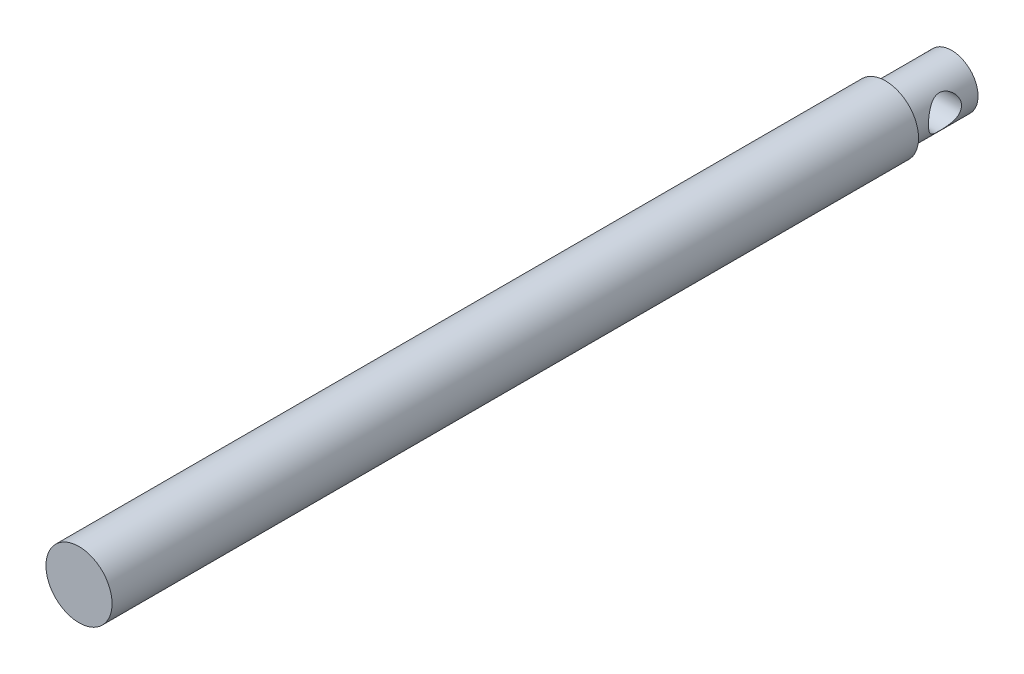
ISO-10303-21;
HEADER;
FILE_DESCRIPTION(('STEP AP214'),'2;1');
FILE_NAME('part.step','',(''),(''),'','','');
FILE_SCHEMA(('AUTOMOTIVE_DESIGN { 1 0 10303 214 1 1 1 1 }'));
ENDSEC;
DATA;
#1=APPLICATION_CONTEXT('core data for automotive mechanical design processes');
#2=APPLICATION_PROTOCOL_DEFINITION('international standard','automotive_design',2000,#1);
#3=PRODUCT_CONTEXT('',#1,'mechanical');
#4=PRODUCT('Part','Part','',(#3));
#5=PRODUCT_RELATED_PRODUCT_CATEGORY('part','',(#4));
#6=PRODUCT_DEFINITION_FORMATION('','',#4);
#7=PRODUCT_DEFINITION_CONTEXT('part definition',#1,'design');
#8=PRODUCT_DEFINITION('design','',#6,#7);
#9=PRODUCT_DEFINITION_SHAPE('','',#8);
#10=(LENGTH_UNIT() NAMED_UNIT(*) SI_UNIT(.MILLI.,.METRE.));
#11=(NAMED_UNIT(*) PLANE_ANGLE_UNIT() SI_UNIT($,.RADIAN.));
#12=(NAMED_UNIT(*) SI_UNIT($,.STERADIAN.) SOLID_ANGLE_UNIT());
#13=UNCERTAINTY_MEASURE_WITH_UNIT(LENGTH_MEASURE(1.E-05),#10,'distance_accuracy_value','');
#14=(GEOMETRIC_REPRESENTATION_CONTEXT(3) GLOBAL_UNCERTAINTY_ASSIGNED_CONTEXT((#13)) GLOBAL_UNIT_ASSIGNED_CONTEXT((#10,
#11,#12)) REPRESENTATION_CONTEXT('',''));
#15=CARTESIAN_POINT('',(0.,0.,0.));
#16=DIRECTION('',(0.,0.,1.));
#17=DIRECTION('',(1.,0.,0.));
#18=AXIS2_PLACEMENT_3D('',#15,#16,#17);
#19=CARTESIAN_POINT('',(0.,0.,122.));
#20=DIRECTION('',(0.,0.,-1.));
#21=DIRECTION('',(-1.,0.,0.));
#22=AXIS2_PLACEMENT_3D('',#19,#20,#21);
#23=CYLINDRICAL_SURFACE('',#22,5.);
#24=CARTESIAN_POINT('',(0.,0.,122.));
#25=DIRECTION('',(0.,0.,1.));
#26=DIRECTION('',(1.,0.,0.));
#27=AXIS2_PLACEMENT_3D('',#24,#25,#26);
#28=CIRCLE('',#27,5.);
#29=CARTESIAN_POINT('',(5.,0.,122.));
#30=VERTEX_POINT('',#29);
#31=EDGE_CURVE('E44',#30,#30,#28,.T.);
#32=ORIENTED_EDGE('',*,*,#31,.F.);
#33=EDGE_LOOP('',(#32));
#34=FACE_BOUND('',#33,.T.);
#35=CARTESIAN_POINT('',(0.,0.,0.));
#36=DIRECTION('',(0.,0.,1.));
#37=DIRECTION('',(1.,0.,0.));
#38=AXIS2_PLACEMENT_3D('',#35,#36,#37);
#39=CIRCLE('',#38,5.);
#40=CARTESIAN_POINT('',(5.,0.,0.));
#41=VERTEX_POINT('',#40);
#42=EDGE_CURVE('E49',#41,#41,#39,.T.);
#43=ORIENTED_EDGE('',*,*,#42,.T.);
#44=EDGE_LOOP('',(#43));
#45=FACE_BOUND('',#44,.T.);
#46=ADVANCED_FACE('F32',(#34,#45),#23,.T.);
#47=CARTESIAN_POINT('',(0.,0.,122.));
#48=DIRECTION('',(0.,0.,1.));
#49=DIRECTION('',(1.,0.,0.));
#50=AXIS2_PLACEMENT_3D('',#47,#48,#49);
#51=PLANE('',#50);
#52=ORIENTED_EDGE('',*,*,#31,.T.);
#53=EDGE_LOOP('',(#52));
#54=FACE_BOUND('',#53,.T.);
#55=ADVANCED_FACE('F79',(#54),#51,.T.);
#56=CARTESIAN_POINT('',(0.,0.,0.));
#57=DIRECTION('',(0.,0.,1.));
#58=DIRECTION('',(1.,0.,0.));
#59=AXIS2_PLACEMENT_3D('',#56,#57,#58);
#60=PLANE('',#59);
#61=CARTESIAN_POINT('',(0.,0.,0.));
#62=DIRECTION('',(0.,0.,-1.));
#63=DIRECTION('',(-1.,0.,0.));
#64=AXIS2_PLACEMENT_3D('',#61,#62,#63);
#65=CIRCLE('',#64,4.);
#66=CARTESIAN_POINT('',(-4.,0.,0.));
#67=VERTEX_POINT('',#66);
#68=EDGE_CURVE('E10',#67,#67,#65,.T.);
#69=ORIENTED_EDGE('',*,*,#68,.F.);
#70=EDGE_LOOP('',(#69));
#71=FACE_BOUND('',#70,.T.);
#72=ORIENTED_EDGE('',*,*,#42,.F.);
#73=EDGE_LOOP('',(#72));
#74=FACE_BOUND('',#73,.T.);
#75=ADVANCED_FACE('F75',(#71,#74),#60,.F.);
#76=CARTESIAN_POINT('',(0.,0.,-10.));
#77=DIRECTION('',(0.,0.,1.));
#78=DIRECTION('',(1.,0.,0.));
#79=AXIS2_PLACEMENT_3D('',#76,#77,#78);
#80=CYLINDRICAL_SURFACE('',#79,4.);
#81=CARTESIAN_POINT('',(4.,0.,-7.5));
#82=CARTESIAN_POINT('',(3.99999041333571,-0.127017476559871,-7.49998952385639));
#83=CARTESIAN_POINT('',(3.9938860659399,-0.254191951791703,-7.49025350009832));
#84=CARTESIAN_POINT('',(3.97004375552586,-0.504637456621344,-7.45182887031573));
#85=CARTESIAN_POINT('',(3.95228361873137,-0.627900575825985,-7.42310413973879));
#86=CARTESIAN_POINT('',(3.90691695293563,-0.866410868269161,-7.34837714671246));
#87=CARTESIAN_POINT('',(3.87935918690877,-0.981694420709429,-7.30246039021243));
#88=CARTESIAN_POINT('',(3.81669199838277,-1.20252080434994,-7.19522833250853));
#89=CARTESIAN_POINT('',(3.7815834126609,-1.30806471304098,-7.13391473744688));
#90=CARTESIAN_POINT('',(3.70340304945467,-1.51594836437078,-6.9922268434089));
#91=CARTESIAN_POINT('',(3.65991924217889,-1.61735911616791,-6.91072139729824));
#92=CARTESIAN_POINT('',(3.57062700058922,-1.80597275567284,-6.73356165374148));
#93=CARTESIAN_POINT('',(3.52481549782957,-1.89315621594404,-6.63788834426107));
#94=CARTESIAN_POINT('',(3.42860837235627,-2.06285746302521,-6.4199322107088));
#95=CARTESIAN_POINT('',(3.37843221966147,-2.14314412018317,-6.29580042656906));
#96=CARTESIAN_POINT('',(3.28660396278105,-2.28147932079995,-6.03287036932165));
#97=CARTESIAN_POINT('',(3.2449375200046,-2.33956541787438,-5.89409737483202));
#98=CARTESIAN_POINT('',(3.18619151248815,-2.41866801180576,-5.64237895245429));
#99=CARTESIAN_POINT('',(3.16553811970886,-2.44539104794679,-5.53206636308169));
#100=CARTESIAN_POINT('',(3.1356271466086,-2.4836368711914,-5.30738814861931));
#101=CARTESIAN_POINT('',(3.12635347378457,-2.49518112485637,-5.19302848282679));
#102=CARTESIAN_POINT('',(3.12059771534501,-2.50237836690497,-4.96317396712363));
#103=CARTESIAN_POINT('',(3.12414917427958,-2.49798968200884,-4.84767692942204));
#104=CARTESIAN_POINT('',(3.14354804883411,-2.47352633347829,-4.61937979127337));
#105=CARTESIAN_POINT('',(3.15940531965489,-2.45343909745149,-4.50658192715007));
#106=CARTESIAN_POINT('',(3.20065145822146,-2.3993620946426,-4.28912310325641));
#107=CARTESIAN_POINT('',(3.22581428653572,-2.36570043522604,-4.18433512028263));
#108=CARTESIAN_POINT('',(3.28291134443418,-2.28580369589507,-3.98167760352679));
#109=CARTESIAN_POINT('',(3.31484796808523,-2.2395641689404,-3.88381053215654));
#110=CARTESIAN_POINT('',(3.38909625095658,-2.12589830407261,-3.67833359248984));
#111=CARTESIAN_POINT('',(3.4322315520855,-2.05612773657746,-3.57231894814762));
#112=CARTESIAN_POINT('',(3.52011451554715,-1.90176111958637,-3.3723388730236));
#113=CARTESIAN_POINT('',(3.56486379714022,-1.81714983251341,-3.27838599995486));
#114=CARTESIAN_POINT('',(3.65959667460597,-1.61904732877734,-3.08939899041739));
#115=CARTESIAN_POINT('',(3.70922571443728,-1.50309447420016,-2.9967440572784));
#116=CARTESIAN_POINT('',(3.8005660184067,-1.25426444468514,-2.83228820636898));
#117=CARTESIAN_POINT('',(3.84228039228673,-1.12139395127005,-2.76047909219051));
#118=CARTESIAN_POINT('',(3.89435975869902,-0.915775751567441,-2.67265404336502));
#119=CARTESIAN_POINT('',(3.90966874385268,-0.848193583187391,-2.64716571356961));
#120=CARTESIAN_POINT('',(3.93701839875445,-0.710492049478444,-2.60199234952136));
#121=CARTESIAN_POINT('',(3.94906095588034,-0.640374175967898,-2.58230396342918));
#122=CARTESIAN_POINT('',(3.96949699527849,-0.498239019538471,-2.54906583835761));
#123=CARTESIAN_POINT('',(3.97789374843884,-0.426223500915275,-2.535510596474));
#124=CARTESIAN_POINT('',(3.99078766491331,-0.280965673560732,-2.51475370668643));
#125=CARTESIAN_POINT('',(3.99528549435853,-0.207723576570751,-2.5075509734527));
#126=CARTESIAN_POINT('',(4.00193773474167,-0.00911917689680599,-2.49689069535646));
#127=CARTESIAN_POINT('',(4.000238122366,0.116782016705694,-2.49959963687648));
#128=CARTESIAN_POINT('',(3.98518313408306,0.365967766011666,-2.52375966446545));
#129=CARTESIAN_POINT('',(3.97182855210102,0.489252499359949,-2.54520947392473));
#130=CARTESIAN_POINT('',(3.93547975555369,0.7250361940026,-2.60447858798278));
#131=CARTESIAN_POINT('',(3.91288306371126,0.837768421062912,-2.64162472076979));
#132=CARTESIAN_POINT('',(3.85991402897874,1.05527816125332,-2.73059237131243));
#133=CARTESIAN_POINT('',(3.82954038411642,1.16005433861599,-2.78241634650143));
#134=CARTESIAN_POINT('',(3.75980014020658,1.37016761969194,-2.90503053750783));
#135=CARTESIAN_POINT('',(3.71983526755373,1.47449380296905,-2.97720717227503));
#136=CARTESIAN_POINT('',(3.63613942885727,1.67028541330073,-3.13558769646929));
#137=CARTESIAN_POINT('',(3.59240430473134,1.76173634038025,-3.22180716888569));
#138=CARTESIAN_POINT('',(3.49811738486729,1.94294835276253,-3.42027008984565));
#139=CARTESIAN_POINT('',(3.44749766579192,2.03053702733638,-3.53447441549752));
#140=CARTESIAN_POINT('',(3.35133525746893,2.18560704916439,-3.77775156698257));
#141=CARTESIAN_POINT('',(3.30578906708369,2.25310231693768,-3.90681401289132));
#142=CARTESIAN_POINT('',(3.23467060578839,2.35369543821018,-4.14938429659957));
#143=CARTESIAN_POINT('',(3.20691272363805,2.39103791720685,-4.26048150138871));
#144=CARTESIAN_POINT('',(3.16210061351252,2.45000216420747,-4.48878629161345));
#145=CARTESIAN_POINT('',(3.1450296652982,2.47164849805251,-4.60598401968943));
#146=CARTESIAN_POINT('',(3.124126499326,2.49802767469226,-4.8441805529704));
#147=CARTESIAN_POINT('',(3.12037003193165,2.50266374586469,-4.96519716787993));
#148=CARTESIAN_POINT('',(3.12698126375719,2.49439556773531,-5.20626192382951));
#149=CARTESIAN_POINT('',(3.13735365770479,2.48148548821457,-5.32630972961936));
#150=CARTESIAN_POINT('',(3.16910777009989,2.44076547086104,-5.55205957943611));
#151=CARTESIAN_POINT('',(3.18953614189074,2.41423847191721,-5.65813856450238));
#152=CARTESIAN_POINT('',(3.23835062785226,2.34835238743426,-5.86427015751826));
#153=CARTESIAN_POINT('',(3.26674005971309,2.3089879509078,-5.96432023181727));
#154=CARTESIAN_POINT('',(3.33327797617852,2.21205415803959,-6.17119332433813));
#155=CARTESIAN_POINT('',(3.3722442852408,2.15267427981667,-6.27689994626374));
#156=CARTESIAN_POINT('',(3.45335445323995,2.01999894889208,-6.47787738570926));
#157=CARTESIAN_POINT('',(3.49550086438999,1.94669224594686,-6.57313966737408));
#158=CARTESIAN_POINT('',(3.58803675426846,1.77134669685941,-6.77002558379843));
#159=CARTESIAN_POINT('',(3.63840488260278,1.66649284489893,-6.86916976153929));
#160=CARTESIAN_POINT('',(3.7339805383823,1.43961937990848,-7.04900159612506));
#161=CARTESIAN_POINT('',(3.77918486147258,1.3175892119665,-7.12967782367752));
#162=CARTESIAN_POINT('',(3.83959214728415,1.12346357942551,-7.23456343855875));
#163=CARTESIAN_POINT('',(3.85851834157058,1.05679601158094,-7.26687480004699));
#164=CARTESIAN_POINT('',(3.89335165397882,0.920199584374063,-7.32567225182379));
#165=CARTESIAN_POINT('',(3.9092605122592,0.850272633931985,-7.3521617011351));
#166=CARTESIAN_POINT('',(3.93753374175517,0.707873688437768,-7.39885714446216));
#167=CARTESIAN_POINT('',(3.94990764965183,0.635409144572266,-7.41908005724566));
#168=CARTESIAN_POINT('',(3.97075677458059,0.488456989557116,-7.45297545558237));
#169=CARTESIAN_POINT('',(3.97923486692924,0.413970913545529,-7.46665277243948));
#170=CARTESIAN_POINT('',(3.99038271291772,0.282852605094051,-7.48459041022673));
#171=CARTESIAN_POINT('',(3.99398159517595,0.226501515914869,-7.49036153025218));
#172=CARTESIAN_POINT('',(3.99879245372932,0.113444074519046,-7.49806878362715));
#173=CARTESIAN_POINT('',(4.00000428228699,0.0567377005313053,-7.50000467961036));
#174=CARTESIAN_POINT('',(4.,0.,-7.5));
#175=B_SPLINE_CURVE_WITH_KNOTS('',3,(#81,#82,#83,#84,#85,#86,#87,#88,#89,#90,#91,#92,#93,#94,
#95,#96,#97,#98,#99,#100,#101,#102,#103,#104,#105,#106,#107,#108,#109,#110,#111,#112,#113,#114,
#115,#116,#117,#118,#119,#120,#121,#122,#123,#124,#125,#126,#127,#128,#129,#130,#131,#132,#133,
#134,#135,#136,#137,#138,#139,#140,#141,#142,#143,#144,#145,#146,#147,#148,#149,#150,#151,#152,
#153,#154,#155,#156,#157,#158,#159,#160,#161,#162,#163,#164,#165,#166,#167,#168,#169,#170,#171,
#172,#173,#174),.UNSPECIFIED.,.T.,.F.,(4,2,2,2,2,2,2,2,2,2,2,2,2,2,2,2,2,2,2,2,2,2,2,2,2,2,2,2,
2,2,2,2,2,2,2,2,2,2,2,2,2,2,2,2,2,2,4),(0.,0.380824602868265,0.762375788256923,1.14205397519027,
1.52169010807759,1.93164374107243,2.34215256651403,2.80825951705947,3.27357449214021,
3.61824017759434,3.96241789414782,4.30749646997556,4.65285169010166,4.99031678920873,
5.32790135816066,5.72854900708719,6.12961045150363,6.59684361399043,7.06389281455722,
7.28510978359955,7.50619865744383,7.72708876613707,7.94794112831293,8.32363778110177,
8.69930884379593,9.06028425977629,9.42132014771965,9.81879878896137,10.216721545704,
10.6724083464246,11.1277787130885,11.4876929754247,11.8470427174174,12.2084336629143,
12.5699447204276,12.9023575499051,13.2349091154192,13.6156046298899,13.9966089922257,
14.4531049498526,14.9098826607203,15.138984863948,15.3679545348469,15.5963005225022,
15.8244777070605,15.994578512822,16.1646898459841),.UNSPECIFIED.);
#176=CARTESIAN_POINT('',(4.,0.,-7.5));
#177=VERTEX_POINT('',#176);
#178=EDGE_CURVE('E35',#177,#177,#175,.T.);
#179=ORIENTED_EDGE('',*,*,#178,.T.);
#180=EDGE_LOOP('',(#179));
#181=FACE_BOUND('',#180,.T.);
#182=CARTESIAN_POINT('',(-4.,0.,-7.5));
#183=CARTESIAN_POINT('',(-3.99999041333571,0.127017476559871,-7.49998952385639));
#184=CARTESIAN_POINT('',(-3.9938860659399,0.254191951791703,-7.49025350009832));
#185=CARTESIAN_POINT('',(-3.97004375552586,0.504637456621344,-7.45182887031573));
#186=CARTESIAN_POINT('',(-3.95228361873137,0.627900575825985,-7.42310413973879));
#187=CARTESIAN_POINT('',(-3.90691695293563,0.866410868269161,-7.34837714671246));
#188=CARTESIAN_POINT('',(-3.87935918690877,0.981694420709429,-7.30246039021243));
#189=CARTESIAN_POINT('',(-3.81669199838277,1.20252080434994,-7.19522833250853));
#190=CARTESIAN_POINT('',(-3.7815834126609,1.30806471304098,-7.13391473744688));
#191=CARTESIAN_POINT('',(-3.70340304945467,1.51594836437078,-6.9922268434089));
#192=CARTESIAN_POINT('',(-3.65991924217889,1.61735911616791,-6.91072139729824));
#193=CARTESIAN_POINT('',(-3.57062700058922,1.80597275567284,-6.73356165374148));
#194=CARTESIAN_POINT('',(-3.52481549782957,1.89315621594404,-6.63788834426107));
#195=CARTESIAN_POINT('',(-3.42860837235627,2.06285746302521,-6.4199322107088));
#196=CARTESIAN_POINT('',(-3.37843221966147,2.14314412018317,-6.29580042656906));
#197=CARTESIAN_POINT('',(-3.28660396278105,2.28147932079995,-6.03287036932165));
#198=CARTESIAN_POINT('',(-3.2449375200046,2.33956541787438,-5.89409737483202));
#199=CARTESIAN_POINT('',(-3.18619151248815,2.41866801180576,-5.64237895245429));
#200=CARTESIAN_POINT('',(-3.16553811970886,2.44539104794679,-5.53206636308169));
#201=CARTESIAN_POINT('',(-3.1356271466086,2.4836368711914,-5.30738814861931));
#202=CARTESIAN_POINT('',(-3.12635347378457,2.49518112485637,-5.19302848282679));
#203=CARTESIAN_POINT('',(-3.12059771534501,2.50237836690497,-4.96317396712363));
#204=CARTESIAN_POINT('',(-3.12414917427958,2.49798968200884,-4.84767692942204));
#205=CARTESIAN_POINT('',(-3.14354804883411,2.47352633347829,-4.61937979127337));
#206=CARTESIAN_POINT('',(-3.15940531965489,2.45343909745149,-4.50658192715007));
#207=CARTESIAN_POINT('',(-3.20065145822146,2.3993620946426,-4.28912310325641));
#208=CARTESIAN_POINT('',(-3.22581428653572,2.36570043522604,-4.18433512028263));
#209=CARTESIAN_POINT('',(-3.28291134443418,2.28580369589507,-3.98167760352679));
#210=CARTESIAN_POINT('',(-3.31484796808523,2.2395641689404,-3.88381053215654));
#211=CARTESIAN_POINT('',(-3.38909625095658,2.12589830407261,-3.67833359248984));
#212=CARTESIAN_POINT('',(-3.4322315520855,2.05612773657746,-3.57231894814762));
#213=CARTESIAN_POINT('',(-3.52011451554715,1.90176111958637,-3.3723388730236));
#214=CARTESIAN_POINT('',(-3.56486379714022,1.81714983251341,-3.27838599995486));
#215=CARTESIAN_POINT('',(-3.65959667460597,1.61904732877734,-3.08939899041739));
#216=CARTESIAN_POINT('',(-3.70922571443728,1.50309447420016,-2.9967440572784));
#217=CARTESIAN_POINT('',(-3.8005660184067,1.25426444468514,-2.83228820636898));
#218=CARTESIAN_POINT('',(-3.84228039228673,1.12139395127005,-2.76047909219051));
#219=CARTESIAN_POINT('',(-3.89435975869902,0.915775751567441,-2.67265404336502));
#220=CARTESIAN_POINT('',(-3.90966874385268,0.848193583187391,-2.64716571356961));
#221=CARTESIAN_POINT('',(-3.93701839875445,0.710492049478444,-2.60199234952136));
#222=CARTESIAN_POINT('',(-3.94906095588034,0.640374175967898,-2.58230396342918));
#223=CARTESIAN_POINT('',(-3.96949699527849,0.498239019538471,-2.54906583835761));
#224=CARTESIAN_POINT('',(-3.97789374843884,0.426223500915275,-2.535510596474));
#225=CARTESIAN_POINT('',(-3.99078766491331,0.280965673560732,-2.51475370668643));
#226=CARTESIAN_POINT('',(-3.99528549435853,0.207723576570751,-2.5075509734527));
#227=CARTESIAN_POINT('',(-4.00193773474167,0.00911917689680599,-2.49689069535646));
#228=CARTESIAN_POINT('',(-4.000238122366,-0.116782016705694,-2.49959963687648));
#229=CARTESIAN_POINT('',(-3.98518313408306,-0.365967766011666,-2.52375966446545));
#230=CARTESIAN_POINT('',(-3.97182855210102,-0.489252499359949,-2.54520947392473));
#231=CARTESIAN_POINT('',(-3.93547975555369,-0.7250361940026,-2.60447858798278));
#232=CARTESIAN_POINT('',(-3.91288306371126,-0.837768421062912,-2.64162472076979));
#233=CARTESIAN_POINT('',(-3.85991402897874,-1.05527816125332,-2.73059237131243));
#234=CARTESIAN_POINT('',(-3.82954038411642,-1.16005433861599,-2.78241634650143));
#235=CARTESIAN_POINT('',(-3.75980014020658,-1.37016761969194,-2.90503053750783));
#236=CARTESIAN_POINT('',(-3.71983526755373,-1.47449380296905,-2.97720717227503));
#237=CARTESIAN_POINT('',(-3.63613942885727,-1.67028541330073,-3.13558769646929));
#238=CARTESIAN_POINT('',(-3.59240430473134,-1.76173634038025,-3.22180716888569));
#239=CARTESIAN_POINT('',(-3.49811738486729,-1.94294835276253,-3.42027008984565));
#240=CARTESIAN_POINT('',(-3.44749766579192,-2.03053702733638,-3.53447441549752));
#241=CARTESIAN_POINT('',(-3.35133525746893,-2.18560704916439,-3.77775156698257));
#242=CARTESIAN_POINT('',(-3.30578906708369,-2.25310231693768,-3.90681401289132));
#243=CARTESIAN_POINT('',(-3.23467060578839,-2.35369543821018,-4.14938429659957));
#244=CARTESIAN_POINT('',(-3.20691272363805,-2.39103791720685,-4.26048150138871));
#245=CARTESIAN_POINT('',(-3.16210061351252,-2.45000216420747,-4.48878629161345));
#246=CARTESIAN_POINT('',(-3.1450296652982,-2.47164849805251,-4.60598401968943));
#247=CARTESIAN_POINT('',(-3.124126499326,-2.49802767469226,-4.8441805529704));
#248=CARTESIAN_POINT('',(-3.12037003193165,-2.50266374586469,-4.96519716787993));
#249=CARTESIAN_POINT('',(-3.12698126375719,-2.49439556773531,-5.20626192382951));
#250=CARTESIAN_POINT('',(-3.13735365770479,-2.48148548821457,-5.32630972961936));
#251=CARTESIAN_POINT('',(-3.16910777009989,-2.44076547086104,-5.55205957943611));
#252=CARTESIAN_POINT('',(-3.18953614189074,-2.41423847191721,-5.65813856450238));
#253=CARTESIAN_POINT('',(-3.23835062785226,-2.34835238743426,-5.86427015751826));
#254=CARTESIAN_POINT('',(-3.26674005971309,-2.3089879509078,-5.96432023181727));
#255=CARTESIAN_POINT('',(-3.33327797617852,-2.21205415803959,-6.17119332433813));
#256=CARTESIAN_POINT('',(-3.3722442852408,-2.15267427981667,-6.27689994626374));
#257=CARTESIAN_POINT('',(-3.45335445323995,-2.01999894889208,-6.47787738570926));
#258=CARTESIAN_POINT('',(-3.49550086438999,-1.94669224594686,-6.57313966737408));
#259=CARTESIAN_POINT('',(-3.58803675426846,-1.77134669685941,-6.77002558379843));
#260=CARTESIAN_POINT('',(-3.63840488260278,-1.66649284489893,-6.86916976153929));
#261=CARTESIAN_POINT('',(-3.7339805383823,-1.43961937990848,-7.04900159612506));
#262=CARTESIAN_POINT('',(-3.77918486147258,-1.3175892119665,-7.12967782367752));
#263=CARTESIAN_POINT('',(-3.83959214728415,-1.12346357942551,-7.23456343855875));
#264=CARTESIAN_POINT('',(-3.85851834157058,-1.05679601158094,-7.26687480004699));
#265=CARTESIAN_POINT('',(-3.89335165397882,-0.920199584374063,-7.32567225182379));
#266=CARTESIAN_POINT('',(-3.9092605122592,-0.850272633931985,-7.3521617011351));
#267=CARTESIAN_POINT('',(-3.93753374175517,-0.707873688437768,-7.39885714446216));
#268=CARTESIAN_POINT('',(-3.94990764965183,-0.635409144572266,-7.41908005724566));
#269=CARTESIAN_POINT('',(-3.97075677458059,-0.488456989557116,-7.45297545558237));
#270=CARTESIAN_POINT('',(-3.97923486692924,-0.413970913545529,-7.46665277243948));
#271=CARTESIAN_POINT('',(-3.99038271291772,-0.282852605094051,-7.48459041022673));
#272=CARTESIAN_POINT('',(-3.99398159517595,-0.226501515914869,-7.49036153025218));
#273=CARTESIAN_POINT('',(-3.99879245372932,-0.113444074519046,-7.49806878362715));
#274=CARTESIAN_POINT('',(-4.00000428228699,-0.0567377005313053,-7.50000467961036));
#275=CARTESIAN_POINT('',(-4.,0.,-7.5));
#276=B_SPLINE_CURVE_WITH_KNOTS('',3,(#182,#183,#184,#185,#186,#187,#188,#189,#190,#191,#192,
#193,#194,#195,#196,#197,#198,#199,#200,#201,#202,#203,#204,#205,#206,#207,#208,#209,#210,#211,
#212,#213,#214,#215,#216,#217,#218,#219,#220,#221,#222,#223,#224,#225,#226,#227,#228,#229,#230,
#231,#232,#233,#234,#235,#236,#237,#238,#239,#240,#241,#242,#243,#244,#245,#246,#247,#248,#249,
#250,#251,#252,#253,#254,#255,#256,#257,#258,#259,#260,#261,#262,#263,#264,#265,#266,#267,#268,
#269,#270,#271,#272,#273,#274,#275),.UNSPECIFIED.,.T.,.F.,(4,2,2,2,2,2,2,2,2,2,2,2,2,2,2,2,2,2,
2,2,2,2,2,2,2,2,2,2,2,2,2,2,2,2,2,2,2,2,2,2,2,2,2,2,2,2,4),(0.,0.380824602868265,
0.762375788256923,1.14205397519027,1.52169010807759,1.93164374107243,2.34215256651403,
2.80825951705947,3.27357449214021,3.61824017759434,3.96241789414782,4.30749646997556,
4.65285169010166,4.99031678920873,5.32790135816066,5.72854900708719,6.12961045150363,
6.59684361399043,7.06389281455722,7.28510978359955,7.50619865744383,7.72708876613707,
7.94794112831293,8.32363778110177,8.69930884379593,9.06028425977629,9.42132014771965,
9.81879878896137,10.216721545704,10.6724083464246,11.1277787130885,11.4876929754247,
11.8470427174174,12.2084336629143,12.5699447204276,12.9023575499051,13.2349091154192,
13.6156046298899,13.9966089922257,14.4531049498526,14.9098826607203,15.138984863948,
15.3679545348469,15.5963005225022,15.8244777070605,15.994578512822,16.1646898459841),.UNSPECIFIED.);
#277=CARTESIAN_POINT('',(-4.,0.,-7.5));
#278=VERTEX_POINT('',#277);
#279=EDGE_CURVE('E55',#278,#278,#276,.T.);
#280=ORIENTED_EDGE('',*,*,#279,.T.);
#281=EDGE_LOOP('',(#280));
#282=FACE_BOUND('',#281,.T.);
#283=CARTESIAN_POINT('',(0.,0.,-10.));
#284=DIRECTION('',(0.,0.,-1.));
#285=DIRECTION('',(-1.,0.,0.));
#286=AXIS2_PLACEMENT_3D('',#283,#284,#285);
#287=CIRCLE('',#286,4.);
#288=CARTESIAN_POINT('',(-4.,0.,-10.));
#289=VERTEX_POINT('',#288);
#290=EDGE_CURVE('E52',#289,#289,#287,.T.);
#291=ORIENTED_EDGE('',*,*,#290,.F.);
#292=EDGE_LOOP('',(#291));
#293=FACE_BOUND('',#292,.T.);
#294=ORIENTED_EDGE('',*,*,#68,.T.);
#295=EDGE_LOOP('',(#294));
#296=FACE_BOUND('',#295,.T.);
#297=ADVANCED_FACE('F60',(#181,#282,#293,#296),#80,.T.);
#298=CARTESIAN_POINT('',(0.,0.,-10.));
#299=DIRECTION('',(0.,0.,-1.));
#300=DIRECTION('',(-1.,0.,0.));
#301=AXIS2_PLACEMENT_3D('',#298,#299,#300);
#302=PLANE('',#301);
#303=ORIENTED_EDGE('',*,*,#290,.T.);
#304=EDGE_LOOP('',(#303));
#305=FACE_BOUND('',#304,.T.);
#306=ADVANCED_FACE('F67',(#305),#302,.T.);
#307=CARTESIAN_POINT('',(-5.,0.,-5.));
#308=DIRECTION('',(1.,0.,0.));
#309=DIRECTION('',(0.,0.,-1.));
#310=AXIS2_PLACEMENT_3D('',#307,#308,#309);
#311=CYLINDRICAL_SURFACE('',#310,2.5);
#312=ORIENTED_EDGE('',*,*,#279,.F.);
#313=EDGE_LOOP('',(#312));
#314=FACE_BOUND('',#313,.T.);
#315=ORIENTED_EDGE('',*,*,#178,.F.);
#316=EDGE_LOOP('',(#315));
#317=FACE_BOUND('',#316,.T.);
#318=ADVANCED_FACE('F64',(#314,#317),#311,.F.);
#319=CLOSED_SHELL('',(#46,#55,#75,#297,#306,#318));
#320=MANIFOLD_SOLID_BREP('B2',#319);
#321=ADVANCED_BREP_SHAPE_REPRESENTATION('',(#18,#320),#14);
#322=SHAPE_DEFINITION_REPRESENTATION(#9,#321);
ENDSEC;
END-ISO-10303-21;
